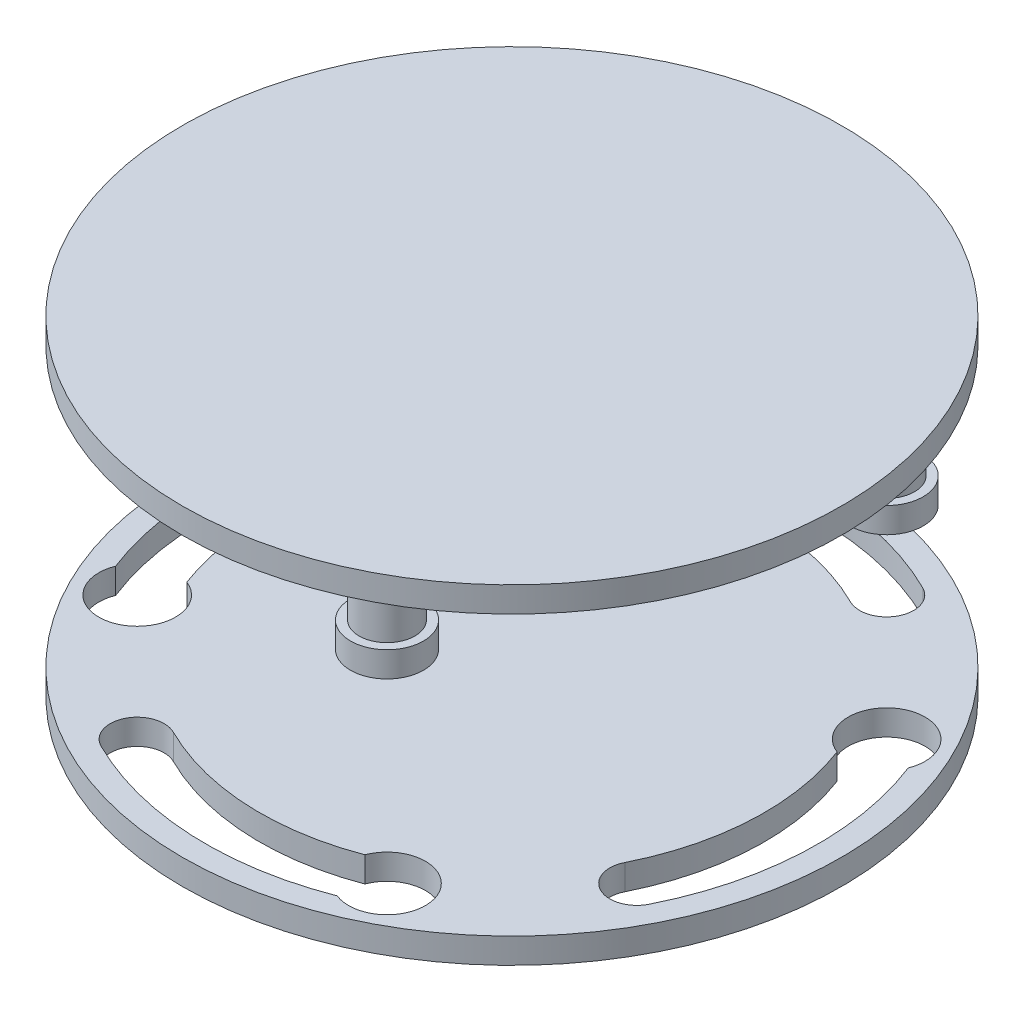
ISO-10303-21;
HEADER;
FILE_DESCRIPTION(('STEP AP214'),'2;1');
FILE_NAME('part.step','',(''),(''),'','','');
FILE_SCHEMA(('AUTOMOTIVE_DESIGN { 1 0 10303 214 1 1 1 1 }'));
ENDSEC;
DATA;
#1=APPLICATION_CONTEXT('core data for automotive mechanical design processes');
#2=APPLICATION_PROTOCOL_DEFINITION('international standard','automotive_design',2000,#1);
#3=PRODUCT_CONTEXT('',#1,'mechanical');
#4=PRODUCT('Part','Part','',(#3));
#5=PRODUCT_RELATED_PRODUCT_CATEGORY('part','',(#4));
#6=PRODUCT_DEFINITION_FORMATION('','',#4);
#7=PRODUCT_DEFINITION_CONTEXT('part definition',#1,'design');
#8=PRODUCT_DEFINITION('design','',#6,#7);
#9=PRODUCT_DEFINITION_SHAPE('','',#8);
#10=(LENGTH_UNIT() NAMED_UNIT(*) SI_UNIT(.MILLI.,.METRE.));
#11=(NAMED_UNIT(*) PLANE_ANGLE_UNIT() SI_UNIT($,.RADIAN.));
#12=(NAMED_UNIT(*) SI_UNIT($,.STERADIAN.) SOLID_ANGLE_UNIT());
#13=UNCERTAINTY_MEASURE_WITH_UNIT(LENGTH_MEASURE(1.E-05),#10,'distance_accuracy_value','');
#14=(GEOMETRIC_REPRESENTATION_CONTEXT(3) GLOBAL_UNCERTAINTY_ASSIGNED_CONTEXT((#13)) GLOBAL_UNIT_ASSIGNED_CONTEXT((#10,
#11,#12)) REPRESENTATION_CONTEXT('',''));
#15=CARTESIAN_POINT('',(0.,0.,0.));
#16=DIRECTION('',(0.,0.,1.));
#17=DIRECTION('',(1.,0.,0.));
#18=AXIS2_PLACEMENT_3D('',#15,#16,#17);
#19=CARTESIAN_POINT('',(0.,65.,0.));
#20=DIRECTION('',(0.,-1.,0.));
#21=DIRECTION('',(0.,0.,-1.));
#22=AXIS2_PLACEMENT_3D('',#19,#20,#21);
#23=CYLINDRICAL_SURFACE('',#22,65.);
#24=CARTESIAN_POINT('',(0.,65.,0.));
#25=DIRECTION('',(0.,1.,0.));
#26=DIRECTION('',(0.,0.,1.));
#27=AXIS2_PLACEMENT_3D('',#24,#25,#26);
#28=CIRCLE('',#27,65.);
#29=CARTESIAN_POINT('',(0.,65.,65.));
#30=VERTEX_POINT('',#29);
#31=EDGE_CURVE('E46',#30,#30,#28,.T.);
#32=ORIENTED_EDGE('',*,*,#31,.F.);
#33=EDGE_LOOP('',(#32));
#34=FACE_BOUND('',#33,.T.);
#35=CARTESIAN_POINT('',(0.,60.,0.));
#36=DIRECTION('',(0.,1.,0.));
#37=DIRECTION('',(0.,0.,1.));
#38=AXIS2_PLACEMENT_3D('',#35,#36,#37);
#39=CIRCLE('',#38,65.);
#40=CARTESIAN_POINT('',(0.,60.,65.));
#41=VERTEX_POINT('',#40);
#42=EDGE_CURVE('E50',#41,#41,#39,.T.);
#43=ORIENTED_EDGE('',*,*,#42,.T.);
#44=EDGE_LOOP('',(#43));
#45=FACE_BOUND('',#44,.T.);
#46=ADVANCED_FACE('F40',(#34,#45),#23,.T.);
#47=CARTESIAN_POINT('',(0.,65.,0.));
#48=DIRECTION('',(0.,1.,0.));
#49=DIRECTION('',(0.,0.,1.));
#50=AXIS2_PLACEMENT_3D('',#47,#48,#49);
#51=PLANE('',#50);
#52=ORIENTED_EDGE('',*,*,#31,.T.);
#53=EDGE_LOOP('',(#52));
#54=FACE_BOUND('',#53,.T.);
#55=ADVANCED_FACE('F121',(#54),#51,.T.);
#56=CARTESIAN_POINT('',(0.,60.,0.));
#57=DIRECTION('',(0.,1.,0.));
#58=DIRECTION('',(0.,0.,1.));
#59=AXIS2_PLACEMENT_3D('',#56,#57,#58);
#60=PLANE('',#59);
#61=CARTESIAN_POINT('',(24.6357509593536,60.,49.2715019187072));
#62=DIRECTION('',(0.,1.,0.));
#63=DIRECTION('',(0.,0.,1.));
#64=AXIS2_PLACEMENT_3D('',#61,#62,#63);
#65=CIRCLE('',#64,5.5);
#66=CARTESIAN_POINT('',(24.6357509593536,60.,54.7715019187072));
#67=VERTEX_POINT('',#66);
#68=EDGE_CURVE('E80',#67,#67,#65,.T.);
#69=ORIENTED_EDGE('',*,*,#68,.T.);
#70=EDGE_LOOP('',(#69));
#71=FACE_BOUND('',#70,.T.);
#72=CARTESIAN_POINT('',(49.2715019187073,60.,-24.6357509593536));
#73=DIRECTION('',(0.,1.,0.));
#74=DIRECTION('',(0.,0.,1.));
#75=AXIS2_PLACEMENT_3D('',#72,#73,#74);
#76=CIRCLE('',#75,5.5);
#77=CARTESIAN_POINT('',(49.2715019187073,60.,-19.1357509593536));
#78=VERTEX_POINT('',#77);
#79=EDGE_CURVE('E75',#78,#78,#76,.T.);
#80=ORIENTED_EDGE('',*,*,#79,.T.);
#81=EDGE_LOOP('',(#80));
#82=FACE_BOUND('',#81,.T.);
#83=CARTESIAN_POINT('',(-49.2728783506602,60.,24.6296638631629));
#84=DIRECTION('',(0.,1.,0.));
#85=DIRECTION('',(0.,0.,1.));
#86=AXIS2_PLACEMENT_3D('',#83,#84,#85);
#87=CIRCLE('',#86,5.5);
#88=CARTESIAN_POINT('',(-49.2728783506602,60.,30.1296638631629));
#89=VERTEX_POINT('',#88);
#90=EDGE_CURVE('E63',#89,#89,#87,.T.);
#91=ORIENTED_EDGE('',*,*,#90,.T.);
#92=EDGE_LOOP('',(#91));
#93=FACE_BOUND('',#92,.T.);
#94=CARTESIAN_POINT('',(-24.6379235207026,60.,-49.2956903275412));
#95=DIRECTION('',(0.,1.,0.));
#96=DIRECTION('',(0.,0.,1.));
#97=AXIS2_PLACEMENT_3D('',#94,#95,#96);
#98=CIRCLE('',#97,5.5);
#99=CARTESIAN_POINT('',(-24.6379235207026,60.,-43.7956903275412));
#100=VERTEX_POINT('',#99);
#101=EDGE_CURVE('E11',#100,#100,#98,.F.);
#102=ORIENTED_EDGE('',*,*,#101,.F.);
#103=EDGE_LOOP('',(#102));
#104=FACE_BOUND('',#103,.T.);
#105=ORIENTED_EDGE('',*,*,#42,.F.);
#106=EDGE_LOOP('',(#105));
#107=FACE_BOUND('',#106,.T.);
#108=ADVANCED_FACE('F126',(#71,#82,#93,#104,#107),#60,.F.);
#109=CARTESIAN_POINT('',(-24.6379235207026,50.,-49.2956903275412));
#110=DIRECTION('',(0.,1.,0.));
#111=DIRECTION('',(0.,0.,1.));
#112=AXIS2_PLACEMENT_3D('',#109,#110,#111);
#113=CYLINDRICAL_SURFACE('',#112,5.5);
#114=CARTESIAN_POINT('',(-24.6379235207026,50.,-49.2956903275412));
#115=DIRECTION('',(0.,-1.,0.));
#116=DIRECTION('',(0.,0.,-1.));
#117=AXIS2_PLACEMENT_3D('',#114,#115,#116);
#118=CIRCLE('',#117,5.5);
#119=CARTESIAN_POINT('',(-24.6379235207026,50.,-54.7956903275412));
#120=VERTEX_POINT('',#119);
#121=EDGE_CURVE('E55',#120,#120,#118,.T.);
#122=ORIENTED_EDGE('',*,*,#121,.F.);
#123=EDGE_LOOP('',(#122));
#124=FACE_BOUND('',#123,.T.);
#125=ORIENTED_EDGE('',*,*,#101,.T.);
#126=EDGE_LOOP('',(#125));
#127=FACE_BOUND('',#126,.T.);
#128=ADVANCED_FACE('F132',(#124,#127),#113,.T.);
#129=CARTESIAN_POINT('',(-24.6379235207026,45.,-49.2956903275412));
#130=DIRECTION('',(0.,1.,0.));
#131=DIRECTION('',(0.,0.,1.));
#132=AXIS2_PLACEMENT_3D('',#129,#130,#131);
#133=CYLINDRICAL_SURFACE('',#132,7.2);
#134=CARTESIAN_POINT('',(-24.6379235207026,45.,-49.2956903275412));
#135=DIRECTION('',(0.,-1.,0.));
#136=DIRECTION('',(0.,0.,-1.));
#137=AXIS2_PLACEMENT_3D('',#134,#135,#136);
#138=CIRCLE('',#137,7.2);
#139=CARTESIAN_POINT('',(-24.6379235207026,45.,-56.4956903275412));
#140=VERTEX_POINT('',#139);
#141=EDGE_CURVE('E59',#140,#140,#138,.T.);
#142=ORIENTED_EDGE('',*,*,#141,.F.);
#143=EDGE_LOOP('',(#142));
#144=FACE_BOUND('',#143,.T.);
#145=CARTESIAN_POINT('',(-24.6379235207026,50.,-49.2956903275412));
#146=DIRECTION('',(0.,-1.,0.));
#147=DIRECTION('',(0.,0.,-1.));
#148=AXIS2_PLACEMENT_3D('',#145,#146,#147);
#149=CIRCLE('',#148,7.2);
#150=CARTESIAN_POINT('',(-24.6379235207026,50.,-56.4956903275412));
#151=VERTEX_POINT('',#150);
#152=EDGE_CURVE('E60',#151,#151,#149,.T.);
#153=ORIENTED_EDGE('',*,*,#152,.T.);
#154=EDGE_LOOP('',(#153));
#155=FACE_BOUND('',#154,.T.);
#156=ADVANCED_FACE('F137',(#144,#155),#133,.T.);
#157=CARTESIAN_POINT('',(-24.6379235207026,45.,-49.2956903275412));
#158=DIRECTION('',(0.,-1.,0.));
#159=DIRECTION('',(0.,0.,-1.));
#160=AXIS2_PLACEMENT_3D('',#157,#158,#159);
#161=PLANE('',#160);
#162=ORIENTED_EDGE('',*,*,#141,.T.);
#163=EDGE_LOOP('',(#162));
#164=FACE_BOUND('',#163,.T.);
#165=ADVANCED_FACE('F144',(#164),#161,.T.);
#166=CARTESIAN_POINT('',(-24.6379235207026,50.,-49.2956903275412));
#167=DIRECTION('',(0.,-1.,0.));
#168=DIRECTION('',(0.,0.,-1.));
#169=AXIS2_PLACEMENT_3D('',#166,#167,#168);
#170=PLANE('',#169);
#171=ORIENTED_EDGE('',*,*,#121,.T.);
#172=EDGE_LOOP('',(#171));
#173=FACE_BOUND('',#172,.T.);
#174=ORIENTED_EDGE('',*,*,#152,.F.);
#175=EDGE_LOOP('',(#174));
#176=FACE_BOUND('',#175,.T.);
#177=ADVANCED_FACE('F146',(#173,#176),#170,.F.);
#178=CARTESIAN_POINT('',(-49.2728783506602,50.,24.6296638631629));
#179=DIRECTION('',(0.,1.,0.));
#180=DIRECTION('',(0.,0.,1.));
#181=AXIS2_PLACEMENT_3D('',#178,#179,#180);
#182=CYLINDRICAL_SURFACE('',#181,5.5);
#183=CARTESIAN_POINT('',(-49.2728783506602,50.,24.6296638631629));
#184=DIRECTION('',(0.,-1.,0.));
#185=DIRECTION('',(0.,0.,-1.));
#186=AXIS2_PLACEMENT_3D('',#183,#184,#185);
#187=CIRCLE('',#186,5.5);
#188=CARTESIAN_POINT('',(-49.2728783506602,50.,19.1296638631629));
#189=VERTEX_POINT('',#188);
#190=EDGE_CURVE('E68',#189,#189,#187,.F.);
#191=ORIENTED_EDGE('',*,*,#190,.T.);
#192=EDGE_LOOP('',(#191));
#193=FACE_BOUND('',#192,.T.);
#194=ORIENTED_EDGE('',*,*,#90,.F.);
#195=EDGE_LOOP('',(#194));
#196=FACE_BOUND('',#195,.T.);
#197=ADVANCED_FACE('F149',(#193,#196),#182,.T.);
#198=CARTESIAN_POINT('',(-49.2535502077413,45.,24.6487759445491));
#199=DIRECTION('',(0.,1.,0.));
#200=DIRECTION('',(0.,0.,1.));
#201=AXIS2_PLACEMENT_3D('',#198,#199,#200);
#202=CYLINDRICAL_SURFACE('',#201,7.2);
#203=CARTESIAN_POINT('',(-49.2535502077413,45.,24.6487759445491));
#204=DIRECTION('',(0.,-1.,0.));
#205=DIRECTION('',(0.,0.,-1.));
#206=AXIS2_PLACEMENT_3D('',#203,#204,#205);
#207=CIRCLE('',#206,7.2);
#208=CARTESIAN_POINT('',(-49.2535502077413,45.,17.4487759445491));
#209=VERTEX_POINT('',#208);
#210=EDGE_CURVE('E71',#209,#209,#207,.T.);
#211=ORIENTED_EDGE('',*,*,#210,.F.);
#212=EDGE_LOOP('',(#211));
#213=FACE_BOUND('',#212,.T.);
#214=CARTESIAN_POINT('',(-49.2535502077413,50.,24.6487759445491));
#215=DIRECTION('',(0.,-1.,0.));
#216=DIRECTION('',(0.,0.,-1.));
#217=AXIS2_PLACEMENT_3D('',#214,#215,#216);
#218=CIRCLE('',#217,7.2);
#219=CARTESIAN_POINT('',(-49.2535502077413,50.,17.4487759445491));
#220=VERTEX_POINT('',#219);
#221=EDGE_CURVE('E72',#220,#220,#218,.T.);
#222=ORIENTED_EDGE('',*,*,#221,.T.);
#223=EDGE_LOOP('',(#222));
#224=FACE_BOUND('',#223,.T.);
#225=ADVANCED_FACE('F156',(#213,#224),#202,.T.);
#226=CARTESIAN_POINT('',(-49.2535502077413,45.,24.6487759445491));
#227=DIRECTION('',(0.,-1.,0.));
#228=DIRECTION('',(0.,0.,-1.));
#229=AXIS2_PLACEMENT_3D('',#226,#227,#228);
#230=PLANE('',#229);
#231=ORIENTED_EDGE('',*,*,#210,.T.);
#232=EDGE_LOOP('',(#231));
#233=FACE_BOUND('',#232,.T.);
#234=ADVANCED_FACE('F160',(#233),#230,.T.);
#235=CARTESIAN_POINT('',(-49.2535502077413,50.,24.6487759445491));
#236=DIRECTION('',(0.,-1.,0.));
#237=DIRECTION('',(0.,0.,-1.));
#238=AXIS2_PLACEMENT_3D('',#235,#236,#237);
#239=PLANE('',#238);
#240=ORIENTED_EDGE('',*,*,#190,.F.);
#241=EDGE_LOOP('',(#240));
#242=FACE_BOUND('',#241,.T.);
#243=ORIENTED_EDGE('',*,*,#221,.F.);
#244=EDGE_LOOP('',(#243));
#245=FACE_BOUND('',#244,.T.);
#246=ADVANCED_FACE('F162',(#242,#245),#239,.F.);
#247=CARTESIAN_POINT('',(49.2715019187073,50.,-24.6357509593536));
#248=DIRECTION('',(0.,1.,0.));
#249=DIRECTION('',(0.,0.,1.));
#250=AXIS2_PLACEMENT_3D('',#247,#248,#249);
#251=CYLINDRICAL_SURFACE('',#250,5.5);
#252=CARTESIAN_POINT('',(49.2715019187073,50.,-24.6357509593536));
#253=DIRECTION('',(0.,-1.,0.));
#254=DIRECTION('',(0.,0.,-1.));
#255=AXIS2_PLACEMENT_3D('',#252,#253,#254);
#256=CIRCLE('',#255,5.5);
#257=CARTESIAN_POINT('',(49.2715019187073,50.,-30.1357509593536));
#258=VERTEX_POINT('',#257);
#259=EDGE_CURVE('E83',#258,#258,#256,.F.);
#260=ORIENTED_EDGE('',*,*,#259,.T.);
#261=EDGE_LOOP('',(#260));
#262=FACE_BOUND('',#261,.T.);
#263=ORIENTED_EDGE('',*,*,#79,.F.);
#264=EDGE_LOOP('',(#263));
#265=FACE_BOUND('',#264,.T.);
#266=ADVANCED_FACE('F165',(#262,#265),#251,.T.);
#267=CARTESIAN_POINT('',(24.6357509593536,50.,49.2715019187072));
#268=DIRECTION('',(0.,1.,0.));
#269=DIRECTION('',(0.,0.,1.));
#270=AXIS2_PLACEMENT_3D('',#267,#268,#269);
#271=CYLINDRICAL_SURFACE('',#270,5.5);
#272=CARTESIAN_POINT('',(24.6357509593536,50.,49.2715019187072));
#273=DIRECTION('',(0.,-1.,0.));
#274=DIRECTION('',(0.,0.,-1.));
#275=AXIS2_PLACEMENT_3D('',#272,#273,#274);
#276=CIRCLE('',#275,5.5);
#277=CARTESIAN_POINT('',(24.6357509593536,50.,43.7715019187072));
#278=VERTEX_POINT('',#277);
#279=EDGE_CURVE('E90',#278,#278,#276,.F.);
#280=ORIENTED_EDGE('',*,*,#279,.T.);
#281=EDGE_LOOP('',(#280));
#282=FACE_BOUND('',#281,.T.);
#283=ORIENTED_EDGE('',*,*,#68,.F.);
#284=EDGE_LOOP('',(#283));
#285=FACE_BOUND('',#284,.T.);
#286=ADVANCED_FACE('F172',(#282,#285),#271,.T.);
#287=CARTESIAN_POINT('',(49.2715019187073,45.,-24.6357509593536));
#288=DIRECTION('',(0.,1.,0.));
#289=DIRECTION('',(0.,0.,1.));
#290=AXIS2_PLACEMENT_3D('',#287,#288,#289);
#291=CYLINDRICAL_SURFACE('',#290,7.2);
#292=CARTESIAN_POINT('',(49.2715019187073,45.,-24.6357509593536));
#293=DIRECTION('',(0.,-1.,0.));
#294=DIRECTION('',(0.,0.,-1.));
#295=AXIS2_PLACEMENT_3D('',#292,#293,#294);
#296=CIRCLE('',#295,7.2);
#297=CARTESIAN_POINT('',(49.2715019187073,45.,-31.8357509593536));
#298=VERTEX_POINT('',#297);
#299=EDGE_CURVE('E86',#298,#298,#296,.T.);
#300=ORIENTED_EDGE('',*,*,#299,.F.);
#301=EDGE_LOOP('',(#300));
#302=FACE_BOUND('',#301,.T.);
#303=CARTESIAN_POINT('',(49.2715019187073,50.,-24.6357509593536));
#304=DIRECTION('',(0.,-1.,0.));
#305=DIRECTION('',(0.,0.,-1.));
#306=AXIS2_PLACEMENT_3D('',#303,#304,#305);
#307=CIRCLE('',#306,7.2);
#308=CARTESIAN_POINT('',(49.2715019187073,50.,-31.8357509593536));
#309=VERTEX_POINT('',#308);
#310=EDGE_CURVE('E87',#309,#309,#307,.T.);
#311=ORIENTED_EDGE('',*,*,#310,.T.);
#312=EDGE_LOOP('',(#311));
#313=FACE_BOUND('',#312,.T.);
#314=ADVANCED_FACE('F176',(#302,#313),#291,.T.);
#315=CARTESIAN_POINT('',(49.2715019187073,45.,-24.6357509593536));
#316=DIRECTION('',(0.,-1.,0.));
#317=DIRECTION('',(0.,0.,-1.));
#318=AXIS2_PLACEMENT_3D('',#315,#316,#317);
#319=PLANE('',#318);
#320=ORIENTED_EDGE('',*,*,#299,.T.);
#321=EDGE_LOOP('',(#320));
#322=FACE_BOUND('',#321,.T.);
#323=ADVANCED_FACE('F180',(#322),#319,.T.);
#324=CARTESIAN_POINT('',(49.2715019187073,50.,-24.6357509593536));
#325=DIRECTION('',(0.,-1.,0.));
#326=DIRECTION('',(0.,0.,-1.));
#327=AXIS2_PLACEMENT_3D('',#324,#325,#326);
#328=PLANE('',#327);
#329=ORIENTED_EDGE('',*,*,#259,.F.);
#330=EDGE_LOOP('',(#329));
#331=FACE_BOUND('',#330,.T.);
#332=ORIENTED_EDGE('',*,*,#310,.F.);
#333=EDGE_LOOP('',(#332));
#334=FACE_BOUND('',#333,.T.);
#335=ADVANCED_FACE('F107',(#331,#334),#328,.F.);
#336=CARTESIAN_POINT('',(24.6357509593536,45.,49.2715019187072));
#337=DIRECTION('',(0.,1.,0.));
#338=DIRECTION('',(0.,0.,1.));
#339=AXIS2_PLACEMENT_3D('',#336,#337,#338);
#340=CYLINDRICAL_SURFACE('',#339,7.2);
#341=CARTESIAN_POINT('',(24.6357509593536,45.,49.2715019187072));
#342=DIRECTION('',(0.,-1.,0.));
#343=DIRECTION('',(0.,0.,-1.));
#344=AXIS2_PLACEMENT_3D('',#341,#342,#343);
#345=CIRCLE('',#344,7.2);
#346=CARTESIAN_POINT('',(24.6357509593536,45.,42.0715019187072));
#347=VERTEX_POINT('',#346);
#348=EDGE_CURVE('E95',#347,#347,#345,.T.);
#349=ORIENTED_EDGE('',*,*,#348,.F.);
#350=EDGE_LOOP('',(#349));
#351=FACE_BOUND('',#350,.T.);
#352=CARTESIAN_POINT('',(24.6357509593536,50.,49.2715019187072));
#353=DIRECTION('',(0.,-1.,0.));
#354=DIRECTION('',(0.,0.,-1.));
#355=AXIS2_PLACEMENT_3D('',#352,#353,#354);
#356=CIRCLE('',#355,7.2);
#357=CARTESIAN_POINT('',(24.6357509593536,50.,42.0715019187072));
#358=VERTEX_POINT('',#357);
#359=EDGE_CURVE('E96',#358,#358,#356,.T.);
#360=ORIENTED_EDGE('',*,*,#359,.T.);
#361=EDGE_LOOP('',(#360));
#362=FACE_BOUND('',#361,.T.);
#363=ADVANCED_FACE('F104',(#351,#362),#340,.T.);
#364=CARTESIAN_POINT('',(24.6357509593536,45.,49.2715019187072));
#365=DIRECTION('',(0.,-1.,0.));
#366=DIRECTION('',(0.,0.,-1.));
#367=AXIS2_PLACEMENT_3D('',#364,#365,#366);
#368=PLANE('',#367);
#369=ORIENTED_EDGE('',*,*,#348,.T.);
#370=EDGE_LOOP('',(#369));
#371=FACE_BOUND('',#370,.T.);
#372=ADVANCED_FACE('F102',(#371),#368,.T.);
#373=CARTESIAN_POINT('',(24.6357509593536,50.,49.2715019187072));
#374=DIRECTION('',(0.,-1.,0.));
#375=DIRECTION('',(0.,0.,-1.));
#376=AXIS2_PLACEMENT_3D('',#373,#374,#375);
#377=PLANE('',#376);
#378=ORIENTED_EDGE('',*,*,#279,.F.);
#379=EDGE_LOOP('',(#378));
#380=FACE_BOUND('',#379,.T.);
#381=ORIENTED_EDGE('',*,*,#359,.F.);
#382=EDGE_LOOP('',(#381));
#383=FACE_BOUND('',#382,.T.);
#384=ADVANCED_FACE('F111',(#380,#383),#377,.F.);
#385=CLOSED_SHELL('',(#46,#55,#108,#128,#156,#165,#177,#197,#225,#234,#246,#266,#286,#314,#323,
#335,#363,#372,#384));
#386=MANIFOLD_SOLID_BREP('B2',#385);
#387=CARTESIAN_POINT('',(0.,5.,0.));
#388=DIRECTION('',(0.,1.,0.));
#389=DIRECTION('',(0.,0.,1.));
#390=AXIS2_PLACEMENT_3D('',#387,#388,#389);
#391=PLANE('',#390);
#392=CARTESIAN_POINT('',(0.,5.,0.));
#393=DIRECTION('',(0.,1.,0.));
#394=DIRECTION('',(0.,0.,1.));
#395=AXIS2_PLACEMENT_3D('',#392,#393,#394);
#396=CIRCLE('',#395,65.);
#397=CARTESIAN_POINT('',(0.,5.,65.));
#398=VERTEX_POINT('',#397);
#399=EDGE_CURVE('E328',#398,#398,#396,.T.);
#400=ORIENTED_EDGE('',*,*,#399,.T.);
#401=EDGE_LOOP('',(#400));
#402=FACE_BOUND('',#401,.T.);
#403=CARTESIAN_POINT('',(0.,5.,0.));
#404=DIRECTION('',(0.,1.,0.));
#405=DIRECTION('',(0.,0.,1.));
#406=AXIS2_PLACEMENT_3D('',#403,#404,#405);
#407=CIRCLE('',#406,49.7691139787905);
#408=CARTESIAN_POINT('',(-22.2574244073022,5.,44.5148488146043));
#409=VERTEX_POINT('',#408);
#410=CARTESIAN_POINT('',(17.5578956778528,5.,46.5691422038186));
#411=VERTEX_POINT('',#410);
#412=EDGE_CURVE('E550',#409,#411,#407,.T.);
#413=ORIENTED_EDGE('',*,*,#412,.T.);
#414=CARTESIAN_POINT('',(24.6357509593536,5.,49.2715019187072));
#415=DIRECTION('',(0.,1.,0.));
#416=DIRECTION('',(0.,0.,1.));
#417=AXIS2_PLACEMENT_3D('',#414,#415,#416);
#418=CIRCLE('',#417,7.57619848040707);
#419=CARTESIAN_POINT('',(21.8475103032967,5.,56.3159676513541));
#420=VERTEX_POINT('',#419);
#421=EDGE_CURVE('E473',#411,#420,#418,.F.);
#422=ORIENTED_EDGE('',*,*,#421,.T.);
#423=CARTESIAN_POINT('',(0.,5.,0.));
#424=DIRECTION('',(0.,1.,0.));
#425=DIRECTION('',(0.,0.,1.));
#426=AXIS2_PLACEMENT_3D('',#423,#424,#425);
#427=CIRCLE('',#426,60.4053136649502);
#428=CARTESIAN_POINT('',(-27.0140775114051,5.,54.0281550228102));
#429=VERTEX_POINT('',#428);
#430=EDGE_CURVE('E539',#429,#420,#427,.T.);
#431=ORIENTED_EDGE('',*,*,#430,.F.);
#432=CARTESIAN_POINT('',(-24.6357509593537,5.,49.2715019187072));
#433=DIRECTION('',(0.,1.,0.));
#434=DIRECTION('',(0.,0.,1.));
#435=AXIS2_PLACEMENT_3D('',#432,#433,#434);
#436=CIRCLE('',#435,5.31809984307982);
#437=EDGE_CURVE('E553',#409,#429,#436,.T.);
#438=ORIENTED_EDGE('',*,*,#437,.F.);
#439=EDGE_LOOP('',(#413,#422,#431,#438));
#440=FACE_BOUND('',#439,.T.);
#441=CARTESIAN_POINT('',(49.2715019187073,5.,24.6357509593536));
#442=DIRECTION('',(0.,1.,0.));
#443=DIRECTION('',(0.,0.,1.));
#444=AXIS2_PLACEMENT_3D('',#441,#442,#443);
#445=CIRCLE('',#444,5.31809984307981);
#446=CARTESIAN_POINT('',(44.5148488146043,5.,22.2574244073021));
#447=VERTEX_POINT('',#446);
#448=CARTESIAN_POINT('',(54.0281550228102,5.,27.0140775114051));
#449=VERTEX_POINT('',#448);
#450=EDGE_CURVE('E520',#447,#449,#445,.T.);
#451=ORIENTED_EDGE('',*,*,#450,.F.);
#452=CARTESIAN_POINT('',(0.,5.,0.));
#453=DIRECTION('',(0.,1.,0.));
#454=DIRECTION('',(0.,0.,1.));
#455=AXIS2_PLACEMENT_3D('',#452,#453,#454);
#456=CIRCLE('',#455,49.7691139787906);
#457=CARTESIAN_POINT('',(46.5691422038187,5.,-17.5578956778528));
#458=VERTEX_POINT('',#457);
#459=EDGE_CURVE('E517',#447,#458,#456,.T.);
#460=ORIENTED_EDGE('',*,*,#459,.T.);
#461=CARTESIAN_POINT('',(49.2715019187073,5.,-24.6357509593536));
#462=DIRECTION('',(0.,1.,0.));
#463=DIRECTION('',(0.,0.,1.));
#464=AXIS2_PLACEMENT_3D('',#461,#462,#463);
#465=CIRCLE('',#464,7.57619848040707);
#466=CARTESIAN_POINT('',(56.315967651354,5.,-21.8475103032969));
#467=VERTEX_POINT('',#466);
#468=EDGE_CURVE('E508',#458,#467,#465,.F.);
#469=ORIENTED_EDGE('',*,*,#468,.T.);
#470=CARTESIAN_POINT('',(0.,5.,0.));
#471=DIRECTION('',(0.,1.,0.));
#472=DIRECTION('',(0.,0.,1.));
#473=AXIS2_PLACEMENT_3D('',#470,#471,#472);
#474=CIRCLE('',#473,60.4053136649502);
#475=EDGE_CURVE('E523',#449,#467,#474,.T.);
#476=ORIENTED_EDGE('',*,*,#475,.F.);
#477=EDGE_LOOP('',(#451,#460,#469,#476));
#478=FACE_BOUND('',#477,.T.);
#479=CARTESIAN_POINT('',(0.,5.,0.));
#480=DIRECTION('',(0.,1.,0.));
#481=DIRECTION('',(0.,0.,1.));
#482=AXIS2_PLACEMENT_3D('',#479,#480,#481);
#483=CIRCLE('',#482,49.7691139787906);
#484=CARTESIAN_POINT('',(-44.5148488146043,5.,-22.2574244073022));
#485=VERTEX_POINT('',#484);
#486=CARTESIAN_POINT('',(-46.5691422038187,5.,17.5578956778528));
#487=VERTEX_POINT('',#486);
#488=EDGE_CURVE('E490',#485,#487,#483,.T.);
#489=ORIENTED_EDGE('',*,*,#488,.T.);
#490=CARTESIAN_POINT('',(-49.2715019187073,5.,24.6357509593536));
#491=DIRECTION('',(0.,1.,0.));
#492=DIRECTION('',(0.,0.,1.));
#493=AXIS2_PLACEMENT_3D('',#490,#491,#492);
#494=CIRCLE('',#493,7.57619848040707);
#495=CARTESIAN_POINT('',(-56.3159676513541,5.,21.8475103032969));
#496=VERTEX_POINT('',#495);
#497=EDGE_CURVE('E343',#487,#496,#494,.F.);
#498=ORIENTED_EDGE('',*,*,#497,.T.);
#499=CARTESIAN_POINT('',(0.,5.,0.));
#500=DIRECTION('',(0.,1.,0.));
#501=DIRECTION('',(0.,0.,1.));
#502=AXIS2_PLACEMENT_3D('',#499,#500,#501);
#503=CIRCLE('',#502,60.4053136649502);
#504=CARTESIAN_POINT('',(-54.0281550228102,5.,-27.0140775114051));
#505=VERTEX_POINT('',#504);
#506=EDGE_CURVE('E480',#505,#496,#503,.T.);
#507=ORIENTED_EDGE('',*,*,#506,.F.);
#508=CARTESIAN_POINT('',(-49.2715019187073,5.,-24.6357509593536));
#509=DIRECTION('',(0.,1.,0.));
#510=DIRECTION('',(0.,0.,1.));
#511=AXIS2_PLACEMENT_3D('',#508,#509,#510);
#512=CIRCLE('',#511,5.31809984307981);
#513=EDGE_CURVE('E494',#485,#505,#512,.T.);
#514=ORIENTED_EDGE('',*,*,#513,.F.);
#515=EDGE_LOOP('',(#489,#498,#507,#514));
#516=FACE_BOUND('',#515,.T.);
#517=CARTESIAN_POINT('',(24.6357509593536,5.,-49.2715019187073));
#518=DIRECTION('',(0.,1.,0.));
#519=DIRECTION('',(0.,0.,1.));
#520=AXIS2_PLACEMENT_3D('',#517,#518,#519);
#521=CIRCLE('',#520,5.3180998430798);
#522=CARTESIAN_POINT('',(22.2574244073022,5.,-44.5148488146043));
#523=VERTEX_POINT('',#522);
#524=CARTESIAN_POINT('',(27.0140775114051,5.,-54.0281550228102));
#525=VERTEX_POINT('',#524);
#526=EDGE_CURVE('E466',#523,#525,#521,.T.);
#527=ORIENTED_EDGE('',*,*,#526,.F.);
#528=CARTESIAN_POINT('',(0.,5.,0.));
#529=DIRECTION('',(0.,1.,0.));
#530=DIRECTION('',(0.,0.,1.));
#531=AXIS2_PLACEMENT_3D('',#528,#529,#530);
#532=CIRCLE('',#531,49.7691139787906);
#533=CARTESIAN_POINT('',(-17.5578956778527,5.,-46.5691422038187));
#534=VERTEX_POINT('',#533);
#535=EDGE_CURVE('E335',#523,#534,#532,.T.);
#536=ORIENTED_EDGE('',*,*,#535,.T.);
#537=CARTESIAN_POINT('',(-24.6357509593536,5.,-49.2715019187073));
#538=DIRECTION('',(0.,1.,0.));
#539=DIRECTION('',(0.,0.,1.));
#540=AXIS2_PLACEMENT_3D('',#537,#538,#539);
#541=CIRCLE('',#540,7.57619848040709);
#542=CARTESIAN_POINT('',(-21.8475103032968,5.,-56.3159676513541));
#543=VERTEX_POINT('',#542);
#544=EDGE_CURVE('E454',#534,#543,#541,.F.);
#545=ORIENTED_EDGE('',*,*,#544,.T.);
#546=CARTESIAN_POINT('',(0.,5.,0.));
#547=DIRECTION('',(0.,1.,0.));
#548=DIRECTION('',(0.,0.,1.));
#549=AXIS2_PLACEMENT_3D('',#546,#547,#548);
#550=CIRCLE('',#549,60.4053136649502);
#551=EDGE_CURVE('E457',#525,#543,#550,.T.);
#552=ORIENTED_EDGE('',*,*,#551,.F.);
#553=EDGE_LOOP('',(#527,#536,#545,#552));
#554=FACE_BOUND('',#553,.T.);
#555=ADVANCED_FACE('F320',(#402,#440,#478,#516,#554),#391,.T.);
#556=CARTESIAN_POINT('',(0.,0.,0.));
#557=DIRECTION('',(0.,1.,0.));
#558=DIRECTION('',(0.,0.,1.));
#559=AXIS2_PLACEMENT_3D('',#556,#557,#558);
#560=PLANE('',#559);
#561=CARTESIAN_POINT('',(0.,0.,0.));
#562=DIRECTION('',(0.,1.,0.));
#563=DIRECTION('',(0.,0.,1.));
#564=AXIS2_PLACEMENT_3D('',#561,#562,#563);
#565=CIRCLE('',#564,4.);
#566=CARTESIAN_POINT('',(0.,0.,4.));
#567=VERTEX_POINT('',#566);
#568=EDGE_CURVE('E38',#567,#567,#565,.F.);
#569=ORIENTED_EDGE('',*,*,#568,.F.);
#570=EDGE_LOOP('',(#569));
#571=FACE_BOUND('',#570,.T.);
#572=CARTESIAN_POINT('',(-49.2715019187073,0.,24.6357509593536));
#573=DIRECTION('',(0.,1.,0.));
#574=DIRECTION('',(0.,0.,1.));
#575=AXIS2_PLACEMENT_3D('',#572,#573,#574);
#576=CIRCLE('',#575,7.57619848040707);
#577=CARTESIAN_POINT('',(-46.5691422038187,0.,17.5578956778528));
#578=VERTEX_POINT('',#577);
#579=CARTESIAN_POINT('',(-56.3159676513541,0.,21.8475103032969));
#580=VERTEX_POINT('',#579);
#581=EDGE_CURVE('E477',#578,#580,#576,.F.);
#582=ORIENTED_EDGE('',*,*,#581,.F.);
#583=CARTESIAN_POINT('',(0.,0.,0.));
#584=DIRECTION('',(0.,1.,0.));
#585=DIRECTION('',(0.,0.,1.));
#586=AXIS2_PLACEMENT_3D('',#583,#584,#585);
#587=CIRCLE('',#586,49.7691139787906);
#588=CARTESIAN_POINT('',(-44.5148488146043,0.,-22.2574244073022));
#589=VERTEX_POINT('',#588);
#590=EDGE_CURVE('E479',#589,#578,#587,.T.);
#591=ORIENTED_EDGE('',*,*,#590,.F.);
#592=CARTESIAN_POINT('',(-49.2715019187073,0.,-24.6357509593536));
#593=DIRECTION('',(0.,1.,0.));
#594=DIRECTION('',(0.,0.,1.));
#595=AXIS2_PLACEMENT_3D('',#592,#593,#594);
#596=CIRCLE('',#595,5.31809984307981);
#597=CARTESIAN_POINT('',(-54.0281550228102,0.,-27.0140775114051));
#598=VERTEX_POINT('',#597);
#599=EDGE_CURVE('E482',#589,#598,#596,.T.);
#600=ORIENTED_EDGE('',*,*,#599,.T.);
#601=CARTESIAN_POINT('',(0.,0.,0.));
#602=DIRECTION('',(0.,1.,0.));
#603=DIRECTION('',(0.,0.,1.));
#604=AXIS2_PLACEMENT_3D('',#601,#602,#603);
#605=CIRCLE('',#604,60.4053136649502);
#606=EDGE_CURVE('E485',#598,#580,#605,.T.);
#607=ORIENTED_EDGE('',*,*,#606,.T.);
#608=EDGE_LOOP('',(#582,#591,#600,#607));
#609=FACE_BOUND('',#608,.T.);
#610=CARTESIAN_POINT('',(24.6357509593536,0.,49.2715019187072));
#611=DIRECTION('',(0.,1.,0.));
#612=DIRECTION('',(0.,0.,1.));
#613=AXIS2_PLACEMENT_3D('',#610,#611,#612);
#614=CIRCLE('',#613,7.57619848040707);
#615=CARTESIAN_POINT('',(17.5578956778528,0.,46.5691422038186));
#616=VERTEX_POINT('',#615);
#617=CARTESIAN_POINT('',(21.8475103032967,0.,56.3159676513541));
#618=VERTEX_POINT('',#617);
#619=EDGE_CURVE('E536',#616,#618,#614,.F.);
#620=ORIENTED_EDGE('',*,*,#619,.F.);
#621=CARTESIAN_POINT('',(0.,0.,0.));
#622=DIRECTION('',(0.,1.,0.));
#623=DIRECTION('',(0.,0.,1.));
#624=AXIS2_PLACEMENT_3D('',#621,#622,#623);
#625=CIRCLE('',#624,49.7691139787905);
#626=CARTESIAN_POINT('',(-22.2574244073021,0.,44.5148488146043));
#627=VERTEX_POINT('',#626);
#628=EDGE_CURVE('E538',#627,#616,#625,.T.);
#629=ORIENTED_EDGE('',*,*,#628,.F.);
#630=CARTESIAN_POINT('',(-24.6357509593537,0.,49.2715019187072));
#631=DIRECTION('',(0.,1.,0.));
#632=DIRECTION('',(0.,0.,1.));
#633=AXIS2_PLACEMENT_3D('',#630,#631,#632);
#634=CIRCLE('',#633,5.31809984307982);
#635=CARTESIAN_POINT('',(-27.0140775114051,0.,54.0281550228102));
#636=VERTEX_POINT('',#635);
#637=EDGE_CURVE('E541',#627,#636,#634,.T.);
#638=ORIENTED_EDGE('',*,*,#637,.T.);
#639=CARTESIAN_POINT('',(0.,0.,0.));
#640=DIRECTION('',(0.,1.,0.));
#641=DIRECTION('',(0.,0.,1.));
#642=AXIS2_PLACEMENT_3D('',#639,#640,#641);
#643=CIRCLE('',#642,60.4053136649502);
#644=EDGE_CURVE('E544',#636,#618,#643,.T.);
#645=ORIENTED_EDGE('',*,*,#644,.T.);
#646=EDGE_LOOP('',(#620,#629,#638,#645));
#647=FACE_BOUND('',#646,.T.);
#648=CARTESIAN_POINT('',(0.,0.,0.));
#649=DIRECTION('',(0.,1.,0.));
#650=DIRECTION('',(0.,0.,1.));
#651=AXIS2_PLACEMENT_3D('',#648,#649,#650);
#652=CIRCLE('',#651,65.);
#653=CARTESIAN_POINT('',(0.,0.,65.));
#654=VERTEX_POINT('',#653);
#655=EDGE_CURVE('E560',#654,#654,#652,.T.);
#656=ORIENTED_EDGE('',*,*,#655,.F.);
#657=EDGE_LOOP('',(#656));
#658=FACE_BOUND('',#657,.T.);
#659=CARTESIAN_POINT('',(0.,0.,0.));
#660=DIRECTION('',(0.,1.,0.));
#661=DIRECTION('',(0.,0.,1.));
#662=AXIS2_PLACEMENT_3D('',#659,#660,#661);
#663=CIRCLE('',#662,49.7691139787906);
#664=CARTESIAN_POINT('',(44.5148488146043,0.,22.2574244073021));
#665=VERTEX_POINT('',#664);
#666=CARTESIAN_POINT('',(46.5691422038187,0.,-17.5578956778528));
#667=VERTEX_POINT('',#666);
#668=EDGE_CURVE('E505',#665,#667,#663,.T.);
#669=ORIENTED_EDGE('',*,*,#668,.F.);
#670=CARTESIAN_POINT('',(49.2715019187073,0.,24.6357509593536));
#671=DIRECTION('',(0.,1.,0.));
#672=DIRECTION('',(0.,0.,1.));
#673=AXIS2_PLACEMENT_3D('',#670,#671,#672);
#674=CIRCLE('',#673,5.31809984307981);
#675=CARTESIAN_POINT('',(54.0281550228102,0.,27.0140775114051));
#676=VERTEX_POINT('',#675);
#677=EDGE_CURVE('E507',#665,#676,#674,.T.);
#678=ORIENTED_EDGE('',*,*,#677,.T.);
#679=CARTESIAN_POINT('',(0.,0.,0.));
#680=DIRECTION('',(0.,1.,0.));
#681=DIRECTION('',(0.,0.,1.));
#682=AXIS2_PLACEMENT_3D('',#679,#680,#681);
#683=CIRCLE('',#682,60.4053136649502);
#684=CARTESIAN_POINT('',(56.315967651354,0.,-21.8475103032969));
#685=VERTEX_POINT('',#684);
#686=EDGE_CURVE('E511',#676,#685,#683,.T.);
#687=ORIENTED_EDGE('',*,*,#686,.T.);
#688=CARTESIAN_POINT('',(49.2715019187073,0.,-24.6357509593536));
#689=DIRECTION('',(0.,1.,0.));
#690=DIRECTION('',(0.,0.,1.));
#691=AXIS2_PLACEMENT_3D('',#688,#689,#690);
#692=CIRCLE('',#691,7.57619848040707);
#693=EDGE_CURVE('E514',#667,#685,#692,.F.);
#694=ORIENTED_EDGE('',*,*,#693,.F.);
#695=EDGE_LOOP('',(#669,#678,#687,#694));
#696=FACE_BOUND('',#695,.T.);
#697=CARTESIAN_POINT('',(0.,0.,0.));
#698=DIRECTION('',(0.,1.,0.));
#699=DIRECTION('',(0.,0.,1.));
#700=AXIS2_PLACEMENT_3D('',#697,#698,#699);
#701=CIRCLE('',#700,49.7691139787906);
#702=CARTESIAN_POINT('',(22.2574244073022,0.,-44.5148488146043));
#703=VERTEX_POINT('',#702);
#704=CARTESIAN_POINT('',(-17.5578956778527,0.,-46.5691422038187));
#705=VERTEX_POINT('',#704);
#706=EDGE_CURVE('E436',#703,#705,#701,.T.);
#707=ORIENTED_EDGE('',*,*,#706,.F.);
#708=CARTESIAN_POINT('',(24.6357509593536,0.,-49.2715019187073));
#709=DIRECTION('',(0.,1.,0.));
#710=DIRECTION('',(0.,0.,1.));
#711=AXIS2_PLACEMENT_3D('',#708,#709,#710);
#712=CIRCLE('',#711,5.3180998430798);
#713=CARTESIAN_POINT('',(27.0140775114051,0.,-54.0281550228102));
#714=VERTEX_POINT('',#713);
#715=EDGE_CURVE('E446',#703,#714,#712,.T.);
#716=ORIENTED_EDGE('',*,*,#715,.T.);
#717=CARTESIAN_POINT('',(0.,0.,0.));
#718=DIRECTION('',(0.,1.,0.));
#719=DIRECTION('',(0.,0.,1.));
#720=AXIS2_PLACEMENT_3D('',#717,#718,#719);
#721=CIRCLE('',#720,60.4053136649502);
#722=CARTESIAN_POINT('',(-21.8475103032968,0.,-56.3159676513541));
#723=VERTEX_POINT('',#722);
#724=EDGE_CURVE('E450',#714,#723,#721,.T.);
#725=ORIENTED_EDGE('',*,*,#724,.T.);
#726=CARTESIAN_POINT('',(-24.6357509593536,0.,-49.2715019187073));
#727=DIRECTION('',(0.,1.,0.));
#728=DIRECTION('',(0.,0.,1.));
#729=AXIS2_PLACEMENT_3D('',#726,#727,#728);
#730=CIRCLE('',#729,7.57619848040709);
#731=EDGE_CURVE('E442',#705,#723,#730,.F.);
#732=ORIENTED_EDGE('',*,*,#731,.F.);
#733=EDGE_LOOP('',(#707,#716,#725,#732));
#734=FACE_BOUND('',#733,.T.);
#735=ADVANCED_FACE('F453',(#571,#609,#647,#658,#696,#734),#560,.F.);
#736=CARTESIAN_POINT('',(0.,5.,0.));
#737=DIRECTION('',(0.,-1.,0.));
#738=DIRECTION('',(0.,0.,-1.));
#739=AXIS2_PLACEMENT_3D('',#736,#737,#738);
#740=CYLINDRICAL_SURFACE('',#739,65.);
#741=ORIENTED_EDGE('',*,*,#399,.F.);
#742=EDGE_LOOP('',(#741));
#743=FACE_BOUND('',#742,.T.);
#744=ORIENTED_EDGE('',*,*,#655,.T.);
#745=EDGE_LOOP('',(#744));
#746=FACE_BOUND('',#745,.T.);
#747=ADVANCED_FACE('F322',(#743,#746),#740,.T.);
#748=CARTESIAN_POINT('',(24.6357509593536,0.,49.2715019187072));
#749=DIRECTION('',(0.,1.,0.));
#750=DIRECTION('',(0.,0.,1.));
#751=AXIS2_PLACEMENT_3D('',#748,#749,#750);
#752=CYLINDRICAL_SURFACE('',#751,7.57619848040707);
#753=ORIENTED_EDGE('',*,*,#421,.F.);
#754=DIRECTION('',(0.,1.,0.));
#755=VECTOR('',#754,1.);
#756=CARTESIAN_POINT('',(17.5578956778528,0.,46.5691422038186));
#757=LINE('',#756,#755);
#758=EDGE_CURVE('E547',#616,#411,#757,.T.);
#759=ORIENTED_EDGE('',*,*,#758,.F.);
#760=ORIENTED_EDGE('',*,*,#619,.T.);
#761=DIRECTION('',(0.,1.,0.));
#762=VECTOR('',#761,1.);
#763=CARTESIAN_POINT('',(21.8475103032967,0.,56.3159676513541));
#764=LINE('',#763,#762);
#765=EDGE_CURVE('E558',#618,#420,#764,.T.);
#766=ORIENTED_EDGE('',*,*,#765,.T.);
#767=EDGE_LOOP('',(#753,#759,#760,#766));
#768=FACE_BOUND('',#767,.T.);
#769=ADVANCED_FACE('F609',(#768),#752,.F.);
#770=CARTESIAN_POINT('',(0.,0.,0.));
#771=DIRECTION('',(0.,1.,0.));
#772=DIRECTION('',(0.,0.,1.));
#773=AXIS2_PLACEMENT_3D('',#770,#771,#772);
#774=CYLINDRICAL_SURFACE('',#773,60.4053136649502);
#775=ORIENTED_EDGE('',*,*,#430,.T.);
#776=ORIENTED_EDGE('',*,*,#765,.F.);
#777=ORIENTED_EDGE('',*,*,#644,.F.);
#778=DIRECTION('',(0.,1.,0.));
#779=VECTOR('',#778,1.);
#780=CARTESIAN_POINT('',(-27.0140775114051,0.,54.0281550228102));
#781=LINE('',#780,#779);
#782=EDGE_CURVE('E561',#636,#429,#781,.T.);
#783=ORIENTED_EDGE('',*,*,#782,.T.);
#784=EDGE_LOOP('',(#775,#776,#777,#783));
#785=FACE_BOUND('',#784,.T.);
#786=ADVANCED_FACE('F612',(#785),#774,.F.);
#787=CARTESIAN_POINT('',(-24.6357509593537,0.,49.2715019187072));
#788=DIRECTION('',(0.,1.,0.));
#789=DIRECTION('',(0.,0.,1.));
#790=AXIS2_PLACEMENT_3D('',#787,#788,#789);
#791=CYLINDRICAL_SURFACE('',#790,5.31809984307982);
#792=ORIENTED_EDGE('',*,*,#437,.T.);
#793=ORIENTED_EDGE('',*,*,#782,.F.);
#794=ORIENTED_EDGE('',*,*,#637,.F.);
#795=DIRECTION('',(0.,1.,0.));
#796=VECTOR('',#795,1.);
#797=CARTESIAN_POINT('',(-22.2574244073022,0.,44.5148488146043));
#798=LINE('',#797,#796);
#799=EDGE_CURVE('E563',#627,#409,#798,.T.);
#800=ORIENTED_EDGE('',*,*,#799,.T.);
#801=EDGE_LOOP('',(#792,#793,#794,#800));
#802=FACE_BOUND('',#801,.T.);
#803=ADVANCED_FACE('F617',(#802),#791,.F.);
#804=CARTESIAN_POINT('',(0.,0.,0.));
#805=DIRECTION('',(0.,1.,0.));
#806=DIRECTION('',(0.,0.,1.));
#807=AXIS2_PLACEMENT_3D('',#804,#805,#806);
#808=CYLINDRICAL_SURFACE('',#807,49.7691139787905);
#809=ORIENTED_EDGE('',*,*,#412,.F.);
#810=ORIENTED_EDGE('',*,*,#799,.F.);
#811=ORIENTED_EDGE('',*,*,#628,.T.);
#812=ORIENTED_EDGE('',*,*,#758,.T.);
#813=EDGE_LOOP('',(#809,#810,#811,#812));
#814=FACE_BOUND('',#813,.T.);
#815=ADVANCED_FACE('F614',(#814),#808,.T.);
#816=CARTESIAN_POINT('',(0.,0.,0.));
#817=DIRECTION('',(0.,1.,0.));
#818=DIRECTION('',(0.,0.,1.));
#819=AXIS2_PLACEMENT_3D('',#816,#817,#818);
#820=CYLINDRICAL_SURFACE('',#819,49.7691139787906);
#821=ORIENTED_EDGE('',*,*,#459,.F.);
#822=DIRECTION('',(0.,1.,0.));
#823=VECTOR('',#822,1.);
#824=CARTESIAN_POINT('',(44.5148488146043,0.,22.2574244073021));
#825=LINE('',#824,#823);
#826=EDGE_CURVE('E516',#665,#447,#825,.T.);
#827=ORIENTED_EDGE('',*,*,#826,.F.);
#828=ORIENTED_EDGE('',*,*,#668,.T.);
#829=DIRECTION('',(0.,1.,0.));
#830=VECTOR('',#829,1.);
#831=CARTESIAN_POINT('',(46.5691422038187,0.,-17.5578956778528));
#832=LINE('',#831,#830);
#833=EDGE_CURVE('E491',#667,#458,#832,.T.);
#834=ORIENTED_EDGE('',*,*,#833,.T.);
#835=EDGE_LOOP('',(#821,#827,#828,#834));
#836=FACE_BOUND('',#835,.T.);
#837=ADVANCED_FACE('F580',(#836),#820,.T.);
#838=CARTESIAN_POINT('',(49.2715019187073,0.,-24.6357509593536));
#839=DIRECTION('',(0.,1.,0.));
#840=DIRECTION('',(0.,0.,1.));
#841=AXIS2_PLACEMENT_3D('',#838,#839,#840);
#842=CYLINDRICAL_SURFACE('',#841,7.57619848040707);
#843=ORIENTED_EDGE('',*,*,#468,.F.);
#844=ORIENTED_EDGE('',*,*,#833,.F.);
#845=ORIENTED_EDGE('',*,*,#693,.T.);
#846=DIRECTION('',(0.,1.,0.));
#847=VECTOR('',#846,1.);
#848=CARTESIAN_POINT('',(56.315967651354,0.,-21.8475103032969));
#849=LINE('',#848,#847);
#850=EDGE_CURVE('E530',#685,#467,#849,.T.);
#851=ORIENTED_EDGE('',*,*,#850,.T.);
#852=EDGE_LOOP('',(#843,#844,#845,#851));
#853=FACE_BOUND('',#852,.T.);
#854=ADVANCED_FACE('F582',(#853),#842,.F.);
#855=CARTESIAN_POINT('',(0.,0.,0.));
#856=DIRECTION('',(0.,1.,0.));
#857=DIRECTION('',(0.,0.,1.));
#858=AXIS2_PLACEMENT_3D('',#855,#856,#857);
#859=CYLINDRICAL_SURFACE('',#858,60.4053136649502);
#860=ORIENTED_EDGE('',*,*,#475,.T.);
#861=ORIENTED_EDGE('',*,*,#850,.F.);
#862=ORIENTED_EDGE('',*,*,#686,.F.);
#863=DIRECTION('',(0.,1.,0.));
#864=VECTOR('',#863,1.);
#865=CARTESIAN_POINT('',(54.0281550228102,0.,27.0140775114051));
#866=LINE('',#865,#864);
#867=EDGE_CURVE('E532',#676,#449,#866,.T.);
#868=ORIENTED_EDGE('',*,*,#867,.T.);
#869=EDGE_LOOP('',(#860,#861,#862,#868));
#870=FACE_BOUND('',#869,.T.);
#871=ADVANCED_FACE('F592',(#870),#859,.F.);
#872=CARTESIAN_POINT('',(49.2715019187073,0.,24.6357509593536));
#873=DIRECTION('',(0.,1.,0.));
#874=DIRECTION('',(0.,0.,1.));
#875=AXIS2_PLACEMENT_3D('',#872,#873,#874);
#876=CYLINDRICAL_SURFACE('',#875,5.31809984307981);
#877=ORIENTED_EDGE('',*,*,#450,.T.);
#878=ORIENTED_EDGE('',*,*,#867,.F.);
#879=ORIENTED_EDGE('',*,*,#677,.F.);
#880=ORIENTED_EDGE('',*,*,#826,.T.);
#881=EDGE_LOOP('',(#877,#878,#879,#880));
#882=FACE_BOUND('',#881,.T.);
#883=ADVANCED_FACE('F589',(#882),#876,.F.);
#884=CARTESIAN_POINT('',(-49.2715019187073,0.,24.6357509593536));
#885=DIRECTION('',(0.,1.,0.));
#886=DIRECTION('',(0.,0.,1.));
#887=AXIS2_PLACEMENT_3D('',#884,#885,#886);
#888=CYLINDRICAL_SURFACE('',#887,7.57619848040707);
#889=ORIENTED_EDGE('',*,*,#497,.F.);
#890=DIRECTION('',(0.,1.,0.));
#891=VECTOR('',#890,1.);
#892=CARTESIAN_POINT('',(-46.5691422038187,0.,17.5578956778528));
#893=LINE('',#892,#891);
#894=EDGE_CURVE('E488',#578,#487,#893,.T.);
#895=ORIENTED_EDGE('',*,*,#894,.F.);
#896=ORIENTED_EDGE('',*,*,#581,.T.);
#897=DIRECTION('',(0.,1.,0.));
#898=VECTOR('',#897,1.);
#899=CARTESIAN_POINT('',(-56.3159676513541,0.,21.8475103032969));
#900=LINE('',#899,#898);
#901=EDGE_CURVE('E467',#580,#496,#900,.T.);
#902=ORIENTED_EDGE('',*,*,#901,.T.);
#903=EDGE_LOOP('',(#889,#895,#896,#902));
#904=FACE_BOUND('',#903,.T.);
#905=ADVANCED_FACE('F599',(#904),#888,.F.);
#906=CARTESIAN_POINT('',(0.,0.,0.));
#907=DIRECTION('',(0.,1.,0.));
#908=DIRECTION('',(0.,0.,1.));
#909=AXIS2_PLACEMENT_3D('',#906,#907,#908);
#910=CYLINDRICAL_SURFACE('',#909,60.4053136649502);
#911=ORIENTED_EDGE('',*,*,#506,.T.);
#912=ORIENTED_EDGE('',*,*,#901,.F.);
#913=ORIENTED_EDGE('',*,*,#606,.F.);
#914=DIRECTION('',(0.,1.,0.));
#915=VECTOR('',#914,1.);
#916=CARTESIAN_POINT('',(-54.0281550228102,0.,-27.0140775114051));
#917=LINE('',#916,#915);
#918=EDGE_CURVE('E500',#598,#505,#917,.T.);
#919=ORIENTED_EDGE('',*,*,#918,.T.);
#920=EDGE_LOOP('',(#911,#912,#913,#919));
#921=FACE_BOUND('',#920,.T.);
#922=ADVANCED_FACE('F654',(#921),#910,.F.);
#923=CARTESIAN_POINT('',(-49.2715019187073,0.,-24.6357509593536));
#924=DIRECTION('',(0.,1.,0.));
#925=DIRECTION('',(0.,0.,1.));
#926=AXIS2_PLACEMENT_3D('',#923,#924,#925);
#927=CYLINDRICAL_SURFACE('',#926,5.31809984307981);
#928=ORIENTED_EDGE('',*,*,#513,.T.);
#929=ORIENTED_EDGE('',*,*,#918,.F.);
#930=ORIENTED_EDGE('',*,*,#599,.F.);
#931=DIRECTION('',(0.,1.,0.));
#932=VECTOR('',#931,1.);
#933=CARTESIAN_POINT('',(-44.5148488146043,0.,-22.2574244073022));
#934=LINE('',#933,#932);
#935=EDGE_CURVE('E502',#589,#485,#934,.T.);
#936=ORIENTED_EDGE('',*,*,#935,.T.);
#937=EDGE_LOOP('',(#928,#929,#930,#936));
#938=FACE_BOUND('',#937,.T.);
#939=ADVANCED_FACE('F663',(#938),#927,.F.);
#940=CARTESIAN_POINT('',(0.,0.,0.));
#941=DIRECTION('',(0.,1.,0.));
#942=DIRECTION('',(0.,0.,1.));
#943=AXIS2_PLACEMENT_3D('',#940,#941,#942);
#944=CYLINDRICAL_SURFACE('',#943,49.7691139787906);
#945=ORIENTED_EDGE('',*,*,#488,.F.);
#946=ORIENTED_EDGE('',*,*,#935,.F.);
#947=ORIENTED_EDGE('',*,*,#590,.T.);
#948=ORIENTED_EDGE('',*,*,#894,.T.);
#949=EDGE_LOOP('',(#945,#946,#947,#948));
#950=FACE_BOUND('',#949,.T.);
#951=ADVANCED_FACE('F673',(#950),#944,.T.);
#952=CARTESIAN_POINT('',(0.,0.,0.));
#953=DIRECTION('',(0.,1.,0.));
#954=DIRECTION('',(0.,0.,1.));
#955=AXIS2_PLACEMENT_3D('',#952,#953,#954);
#956=CYLINDRICAL_SURFACE('',#955,49.7691139787906);
#957=ORIENTED_EDGE('',*,*,#535,.F.);
#958=DIRECTION('',(0.,1.,0.));
#959=VECTOR('',#958,1.);
#960=CARTESIAN_POINT('',(22.2574244073022,0.,-44.5148488146043));
#961=LINE('',#960,#959);
#962=EDGE_CURVE('E432',#703,#523,#961,.T.);
#963=ORIENTED_EDGE('',*,*,#962,.F.);
#964=ORIENTED_EDGE('',*,*,#706,.T.);
#965=DIRECTION('',(0.,1.,0.));
#966=VECTOR('',#965,1.);
#967=CARTESIAN_POINT('',(-17.5578956778527,0.,-46.5691422038187));
#968=LINE('',#967,#966);
#969=EDGE_CURVE('E471',#705,#534,#968,.T.);
#970=ORIENTED_EDGE('',*,*,#969,.T.);
#971=EDGE_LOOP('',(#957,#963,#964,#970));
#972=FACE_BOUND('',#971,.T.);
#973=ADVANCED_FACE('F434',(#972),#956,.T.);
#974=CARTESIAN_POINT('',(-24.6357509593536,0.,-49.2715019187073));
#975=DIRECTION('',(0.,1.,0.));
#976=DIRECTION('',(0.,0.,1.));
#977=AXIS2_PLACEMENT_3D('',#974,#975,#976);
#978=CYLINDRICAL_SURFACE('',#977,7.57619848040709);
#979=ORIENTED_EDGE('',*,*,#544,.F.);
#980=ORIENTED_EDGE('',*,*,#969,.F.);
#981=ORIENTED_EDGE('',*,*,#731,.T.);
#982=DIRECTION('',(0.,1.,0.));
#983=VECTOR('',#982,1.);
#984=CARTESIAN_POINT('',(-21.8475103032968,0.,-56.3159676513541));
#985=LINE('',#984,#983);
#986=EDGE_CURVE('E474',#723,#543,#985,.T.);
#987=ORIENTED_EDGE('',*,*,#986,.T.);
#988=EDGE_LOOP('',(#979,#980,#981,#987));
#989=FACE_BOUND('',#988,.T.);
#990=ADVANCED_FACE('F692',(#989),#978,.F.);
#991=CARTESIAN_POINT('',(0.,0.,0.));
#992=DIRECTION('',(0.,1.,0.));
#993=DIRECTION('',(0.,0.,1.));
#994=AXIS2_PLACEMENT_3D('',#991,#992,#993);
#995=CYLINDRICAL_SURFACE('',#994,60.4053136649502);
#996=ORIENTED_EDGE('',*,*,#551,.T.);
#997=ORIENTED_EDGE('',*,*,#986,.F.);
#998=ORIENTED_EDGE('',*,*,#724,.F.);
#999=DIRECTION('',(0.,1.,0.));
#1000=VECTOR('',#999,1.);
#1001=CARTESIAN_POINT('',(27.0140775114051,0.,-54.0281550228102));
#1002=LINE('',#1001,#1000);
#1003=EDGE_CURVE('E441',#714,#525,#1002,.T.);
#1004=ORIENTED_EDGE('',*,*,#1003,.T.);
#1005=EDGE_LOOP('',(#996,#997,#998,#1004));
#1006=FACE_BOUND('',#1005,.T.);
#1007=ADVANCED_FACE('F701',(#1006),#995,.F.);
#1008=CARTESIAN_POINT('',(24.6357509593536,0.,-49.2715019187073));
#1009=DIRECTION('',(0.,1.,0.));
#1010=DIRECTION('',(0.,0.,1.));
#1011=AXIS2_PLACEMENT_3D('',#1008,#1009,#1010);
#1012=CYLINDRICAL_SURFACE('',#1011,5.3180998430798);
#1013=ORIENTED_EDGE('',*,*,#526,.T.);
#1014=ORIENTED_EDGE('',*,*,#1003,.F.);
#1015=ORIENTED_EDGE('',*,*,#715,.F.);
#1016=ORIENTED_EDGE('',*,*,#962,.T.);
#1017=EDGE_LOOP('',(#1013,#1014,#1015,#1016));
#1018=FACE_BOUND('',#1017,.T.);
#1019=ADVANCED_FACE('F447',(#1018),#1012,.F.);
#1020=CARTESIAN_POINT('',(0.,-5.,0.));
#1021=DIRECTION('',(0.,1.,0.));
#1022=DIRECTION('',(0.,0.,1.));
#1023=AXIS2_PLACEMENT_3D('',#1020,#1021,#1022);
#1024=CYLINDRICAL_SURFACE('',#1023,4.);
#1025=CARTESIAN_POINT('',(0.,-5.,0.));
#1026=DIRECTION('',(0.,-1.,0.));
#1027=DIRECTION('',(0.,0.,-1.));
#1028=AXIS2_PLACEMENT_3D('',#1025,#1026,#1027);
#1029=CIRCLE('',#1028,4.);
#1030=CARTESIAN_POINT('',(0.,-5.,-4.));
#1031=VERTEX_POINT('',#1030);
#1032=EDGE_CURVE('E460',#1031,#1031,#1029,.T.);
#1033=ORIENTED_EDGE('',*,*,#1032,.F.);
#1034=EDGE_LOOP('',(#1033));
#1035=FACE_BOUND('',#1034,.T.);
#1036=ORIENTED_EDGE('',*,*,#568,.T.);
#1037=EDGE_LOOP('',(#1036));
#1038=FACE_BOUND('',#1037,.T.);
#1039=ADVANCED_FACE('F720',(#1035,#1038),#1024,.T.);
#1040=CARTESIAN_POINT('',(0.,-5.,0.));
#1041=DIRECTION('',(0.,-1.,0.));
#1042=DIRECTION('',(0.,0.,-1.));
#1043=AXIS2_PLACEMENT_3D('',#1040,#1041,#1042);
#1044=PLANE('',#1043);
#1045=CARTESIAN_POINT('',(0.,-5.,0.));
#1046=DIRECTION('',(0.,-1.,0.));
#1047=DIRECTION('',(0.,0.,-1.));
#1048=AXIS2_PLACEMENT_3D('',#1045,#1046,#1047);
#1049=CIRCLE('',#1048,1.);
#1050=CARTESIAN_POINT('',(0.,-5.,-1.));
#1051=VERTEX_POINT('',#1050);
#1052=EDGE_CURVE('E775',#1051,#1051,#1049,.T.);
#1053=ORIENTED_EDGE('',*,*,#1052,.F.);
#1054=EDGE_LOOP('',(#1053));
#1055=FACE_BOUND('',#1054,.T.);
#1056=ORIENTED_EDGE('',*,*,#1032,.T.);
#1057=EDGE_LOOP('',(#1056));
#1058=FACE_BOUND('',#1057,.T.);
#1059=ADVANCED_FACE('F738',(#1055,#1058),#1044,.T.);
#1060=CARTESIAN_POINT('',(0.,0.,0.));
#1061=DIRECTION('',(0.,-1.,0.));
#1062=DIRECTION('',(0.,0.,-1.));
#1063=AXIS2_PLACEMENT_3D('',#1060,#1061,#1062);
#1064=CYLINDRICAL_SURFACE('',#1063,1.);
#1065=CARTESIAN_POINT('',(0.,0.,0.));
#1066=DIRECTION('',(0.,-1.,0.));
#1067=DIRECTION('',(0.,0.,-1.));
#1068=AXIS2_PLACEMENT_3D('',#1065,#1066,#1067);
#1069=CIRCLE('',#1068,1.);
#1070=CARTESIAN_POINT('',(0.,0.,-1.));
#1071=VERTEX_POINT('',#1070);
#1072=EDGE_CURVE('E774',#1071,#1071,#1069,.T.);
#1073=ORIENTED_EDGE('',*,*,#1072,.F.);
#1074=EDGE_LOOP('',(#1073));
#1075=FACE_BOUND('',#1074,.T.);
#1076=ORIENTED_EDGE('',*,*,#1052,.T.);
#1077=EDGE_LOOP('',(#1076));
#1078=FACE_BOUND('',#1077,.T.);
#1079=ADVANCED_FACE('F748',(#1075,#1078),#1064,.F.);
#1080=CARTESIAN_POINT('',(0.,0.,0.));
#1081=DIRECTION('',(0.,-1.,0.));
#1082=DIRECTION('',(0.,0.,-1.));
#1083=AXIS2_PLACEMENT_3D('',#1080,#1081,#1082);
#1084=PLANE('',#1083);
#1085=ORIENTED_EDGE('',*,*,#1072,.T.);
#1086=EDGE_LOOP('',(#1085));
#1087=FACE_BOUND('',#1086,.T.);
#1088=ADVANCED_FACE('F758',(#1087),#1084,.T.);
#1089=CLOSED_SHELL('',(#555,#735,#747,#769,#786,#803,#815,#837,#854,#871,#883,#905,#922,#939,
#951,#973,#990,#1007,#1019,#1039,#1059,#1079,#1088));
#1090=MANIFOLD_SOLID_BREP('B6',#1089);
#1091=ADVANCED_BREP_SHAPE_REPRESENTATION('',(#18,#386,#1090),#14);
#1092=SHAPE_DEFINITION_REPRESENTATION(#9,#1091);
ENDSEC;
END-ISO-10303-21;
